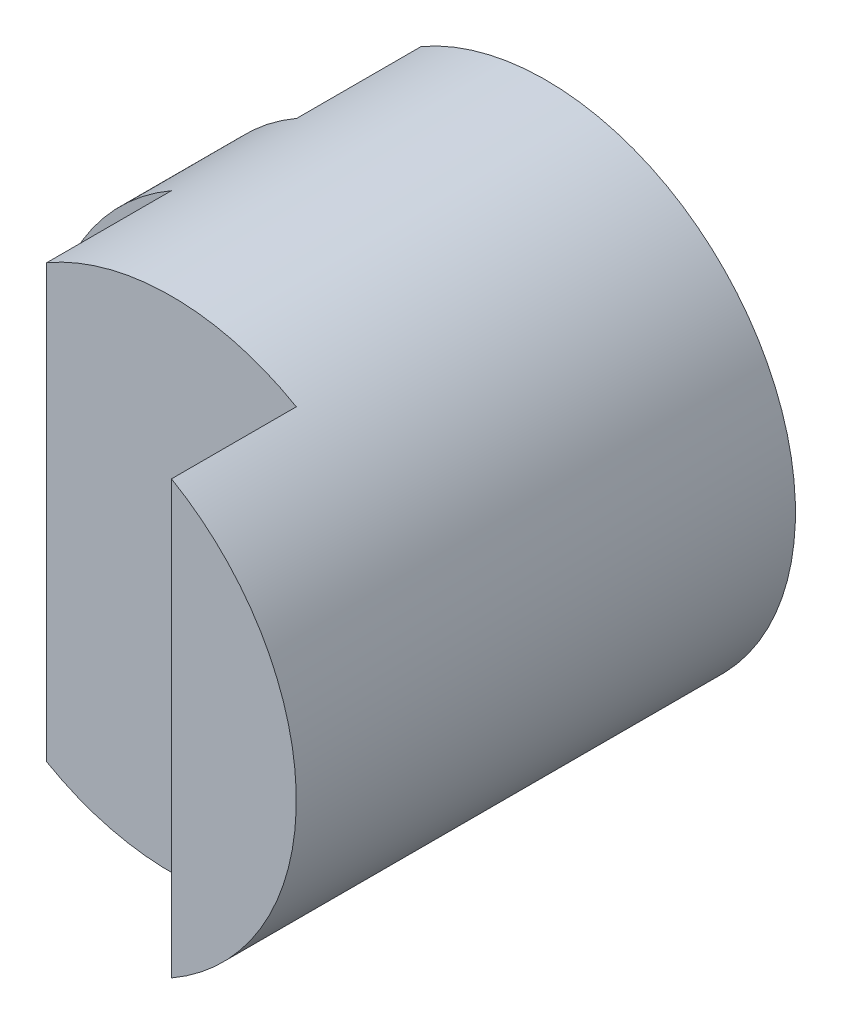
ISO-10303-21;
HEADER;
FILE_DESCRIPTION(('STEP AP214'),'2;1');
FILE_NAME('part.step','',(''),(''),'','','');
FILE_SCHEMA(('AUTOMOTIVE_DESIGN { 1 0 10303 214 1 1 1 1 }'));
ENDSEC;
DATA;
#1=APPLICATION_CONTEXT('core data for automotive mechanical design processes');
#2=APPLICATION_PROTOCOL_DEFINITION('international standard','automotive_design',2000,#1);
#3=PRODUCT_CONTEXT('',#1,'mechanical');
#4=PRODUCT('Part','Part','',(#3));
#5=PRODUCT_RELATED_PRODUCT_CATEGORY('part','',(#4));
#6=PRODUCT_DEFINITION_FORMATION('','',#4);
#7=PRODUCT_DEFINITION_CONTEXT('part definition',#1,'design');
#8=PRODUCT_DEFINITION('design','',#6,#7);
#9=PRODUCT_DEFINITION_SHAPE('','',#8);
#10=(LENGTH_UNIT() NAMED_UNIT(*) SI_UNIT(.MILLI.,.METRE.));
#11=(NAMED_UNIT(*) PLANE_ANGLE_UNIT() SI_UNIT($,.RADIAN.));
#12=(NAMED_UNIT(*) SI_UNIT($,.STERADIAN.) SOLID_ANGLE_UNIT());
#13=UNCERTAINTY_MEASURE_WITH_UNIT(LENGTH_MEASURE(1.E-05),#10,'distance_accuracy_value','');
#14=(GEOMETRIC_REPRESENTATION_CONTEXT(3) GLOBAL_UNCERTAINTY_ASSIGNED_CONTEXT((#13)) GLOBAL_UNIT_ASSIGNED_CONTEXT((#10,
#11,#12)) REPRESENTATION_CONTEXT('',''));
#15=CARTESIAN_POINT('',(0.,0.,0.));
#16=DIRECTION('',(0.,0.,1.));
#17=DIRECTION('',(1.,0.,0.));
#18=AXIS2_PLACEMENT_3D('',#15,#16,#17);
#19=CARTESIAN_POINT('',(0.,0.,4.));
#20=DIRECTION('',(0.,0.,-1.));
#21=DIRECTION('',(-1.,0.,0.));
#22=AXIS2_PLACEMENT_3D('',#19,#20,#21);
#23=CYLINDRICAL_SURFACE('',#22,2.);
#24=CARTESIAN_POINT('',(0.,0.,4.));
#25=DIRECTION('',(0.,0.,1.));
#26=DIRECTION('',(1.,0.,0.));
#27=AXIS2_PLACEMENT_3D('',#24,#25,#26);
#28=CIRCLE('',#27,2.);
#29=CARTESIAN_POINT('',(1.,-1.73205080756888,4.));
#30=VERTEX_POINT('',#29);
#31=CARTESIAN_POINT('',(1.,1.73205080756888,4.));
#32=VERTEX_POINT('',#31);
#33=EDGE_CURVE('E136',#30,#32,#28,.T.);
#34=ORIENTED_EDGE('',*,*,#33,.F.);
#35=DIRECTION('',(0.,0.,-1.));
#36=VECTOR('',#35,1.);
#37=CARTESIAN_POINT('',(1.,-1.73205080756888,4.));
#38=LINE('',#37,#36);
#39=CARTESIAN_POINT('',(1.,-1.73205080756888,3.));
#40=VERTEX_POINT('',#39);
#41=EDGE_CURVE('E47',#30,#40,#38,.T.);
#42=ORIENTED_EDGE('',*,*,#41,.T.);
#43=CARTESIAN_POINT('',(0.,0.,3.));
#44=DIRECTION('',(0.,0.,-1.));
#45=DIRECTION('',(-1.,0.,0.));
#46=AXIS2_PLACEMENT_3D('',#43,#44,#45);
#47=CIRCLE('',#46,2.);
#48=CARTESIAN_POINT('',(-1.,-1.73205080756888,3.));
#49=VERTEX_POINT('',#48);
#50=EDGE_CURVE('E105',#40,#49,#47,.T.);
#51=ORIENTED_EDGE('',*,*,#50,.T.);
#52=DIRECTION('',(0.,0.,-1.));
#53=VECTOR('',#52,1.);
#54=CARTESIAN_POINT('',(-1.,-1.73205080756888,4.));
#55=LINE('',#54,#53);
#56=CARTESIAN_POINT('',(-1.,-1.73205080756888,2.));
#57=VERTEX_POINT('',#56);
#58=EDGE_CURVE('E110',#49,#57,#55,.T.);
#59=ORIENTED_EDGE('',*,*,#58,.T.);
#60=CARTESIAN_POINT('',(0.,0.,2.));
#61=DIRECTION('',(0.,0.,-1.));
#62=DIRECTION('',(-1.,0.,0.));
#63=AXIS2_PLACEMENT_3D('',#60,#61,#62);
#64=CIRCLE('',#63,2.);
#65=CARTESIAN_POINT('',(-1.,1.73205080756888,2.));
#66=VERTEX_POINT('',#65);
#67=EDGE_CURVE('E40',#57,#66,#64,.T.);
#68=ORIENTED_EDGE('',*,*,#67,.T.);
#69=DIRECTION('',(0.,0.,-1.));
#70=VECTOR('',#69,1.);
#71=CARTESIAN_POINT('',(-1.,1.73205080756888,4.));
#72=LINE('',#71,#70);
#73=CARTESIAN_POINT('',(-1.,1.73205080756888,3.));
#74=VERTEX_POINT('',#73);
#75=EDGE_CURVE('E11',#66,#74,#72,.F.);
#76=ORIENTED_EDGE('',*,*,#75,.T.);
#77=CARTESIAN_POINT('',(1.,1.73205080756888,3.));
#78=VERTEX_POINT('',#77);
#79=EDGE_CURVE('E101',#74,#78,#47,.T.);
#80=ORIENTED_EDGE('',*,*,#79,.T.);
#81=DIRECTION('',(0.,0.,-1.));
#82=VECTOR('',#81,1.);
#83=CARTESIAN_POINT('',(1.,1.73205080756888,4.));
#84=LINE('',#83,#82);
#85=EDGE_CURVE('E94',#78,#32,#84,.F.);
#86=ORIENTED_EDGE('',*,*,#85,.T.);
#87=EDGE_LOOP('',(#34,#42,#51,#59,#68,#76,#80,#86));
#88=FACE_BOUND('',#87,.T.);
#89=CARTESIAN_POINT('',(0.,0.,0.));
#90=DIRECTION('',(0.,0.,1.));
#91=DIRECTION('',(1.,0.,0.));
#92=AXIS2_PLACEMENT_3D('',#89,#90,#91);
#93=CIRCLE('',#92,2.);
#94=CARTESIAN_POINT('',(-1.,-1.73205080756888,0.));
#95=VERTEX_POINT('',#94);
#96=CARTESIAN_POINT('',(-1.,1.73205080756888,0.));
#97=VERTEX_POINT('',#96);
#98=EDGE_CURVE('E135',#95,#97,#93,.T.);
#99=ORIENTED_EDGE('',*,*,#98,.T.);
#100=DIRECTION('',(0.,0.,-1.));
#101=VECTOR('',#100,1.);
#102=CARTESIAN_POINT('',(-1.,1.73205080756888,4.));
#103=LINE('',#102,#101);
#104=CARTESIAN_POINT('',(-1.,1.73205080756888,0.996424706562642));
#105=VERTEX_POINT('',#104);
#106=EDGE_CURVE('E55',#97,#105,#103,.F.);
#107=ORIENTED_EDGE('',*,*,#106,.T.);
#108=CARTESIAN_POINT('',(0.,0.,0.996424706562642));
#109=DIRECTION('',(0.,0.,1.));
#110=DIRECTION('',(1.,0.,0.));
#111=AXIS2_PLACEMENT_3D('',#108,#109,#110);
#112=CIRCLE('',#111,2.);
#113=CARTESIAN_POINT('',(-1.,-1.73205080756888,0.996424706562642));
#114=VERTEX_POINT('',#113);
#115=EDGE_CURVE('E98',#105,#114,#112,.T.);
#116=ORIENTED_EDGE('',*,*,#115,.T.);
#117=DIRECTION('',(0.,0.,-1.));
#118=VECTOR('',#117,1.);
#119=CARTESIAN_POINT('',(-1.,-1.73205080756888,4.));
#120=LINE('',#119,#118);
#121=EDGE_CURVE('E85',#114,#95,#120,.T.);
#122=ORIENTED_EDGE('',*,*,#121,.T.);
#123=EDGE_LOOP('',(#99,#107,#116,#122));
#124=FACE_BOUND('',#123,.T.);
#125=ADVANCED_FACE('F33',(#88,#124),#23,.T.);
#126=CARTESIAN_POINT('',(0.,0.,4.));
#127=DIRECTION('',(0.,0.,1.));
#128=DIRECTION('',(1.,0.,0.));
#129=AXIS2_PLACEMENT_3D('',#126,#127,#128);
#130=PLANE('',#129);
#131=DIRECTION('',(0.,1.,0.));
#132=VECTOR('',#131,1.);
#133=CARTESIAN_POINT('',(1.,0.,4.));
#134=LINE('',#133,#132);
#135=EDGE_CURVE('E102',#30,#32,#134,.T.);
#136=ORIENTED_EDGE('',*,*,#135,.F.);
#137=ORIENTED_EDGE('',*,*,#33,.T.);
#138=EDGE_LOOP('',(#136,#137));
#139=FACE_BOUND('',#138,.T.);
#140=ADVANCED_FACE('F142',(#139),#130,.T.);
#141=CARTESIAN_POINT('',(0.,0.,0.));
#142=DIRECTION('',(0.,0.,1.));
#143=DIRECTION('',(1.,0.,0.));
#144=AXIS2_PLACEMENT_3D('',#141,#142,#143);
#145=PLANE('',#144);
#146=ORIENTED_EDGE('',*,*,#98,.F.);
#147=DIRECTION('',(0.,1.,0.));
#148=VECTOR('',#147,1.);
#149=CARTESIAN_POINT('',(-1.,0.,0.));
#150=LINE('',#149,#148);
#151=EDGE_CURVE('E89',#95,#97,#150,.T.);
#152=ORIENTED_EDGE('',*,*,#151,.T.);
#153=EDGE_LOOP('',(#146,#152));
#154=FACE_BOUND('',#153,.T.);
#155=ADVANCED_FACE('F140',(#154),#145,.F.);
#156=CARTESIAN_POINT('',(-1.,-2.,0.996424706562642));
#157=DIRECTION('',(0.,0.,1.));
#158=DIRECTION('',(1.,0.,0.));
#159=AXIS2_PLACEMENT_3D('',#156,#157,#158);
#160=PLANE('',#159);
#161=DIRECTION('',(0.,1.,0.));
#162=VECTOR('',#161,1.);
#163=CARTESIAN_POINT('',(-1.,-2.,0.996424706562642));
#164=LINE('',#163,#162);
#165=EDGE_CURVE('E88',#114,#105,#164,.T.);
#166=ORIENTED_EDGE('',*,*,#165,.F.);
#167=ORIENTED_EDGE('',*,*,#115,.F.);
#168=EDGE_LOOP('',(#166,#167));
#169=FACE_BOUND('',#168,.T.);
#170=ADVANCED_FACE('F97',(#169),#160,.F.);
#171=CARTESIAN_POINT('',(-1.,-2.,0.996424706562642));
#172=DIRECTION('',(1.,0.,0.));
#173=DIRECTION('',(0.,0.,-1.));
#174=AXIS2_PLACEMENT_3D('',#171,#172,#173);
#175=PLANE('',#174);
#176=ORIENTED_EDGE('',*,*,#165,.T.);
#177=ORIENTED_EDGE('',*,*,#106,.F.);
#178=ORIENTED_EDGE('',*,*,#151,.F.);
#179=ORIENTED_EDGE('',*,*,#121,.F.);
#180=EDGE_LOOP('',(#176,#177,#178,#179));
#181=FACE_BOUND('',#180,.T.);
#182=ADVANCED_FACE('F87',(#181),#175,.F.);
#183=CARTESIAN_POINT('',(-2.,-2.,2.));
#184=DIRECTION('',(0.,0.,-1.));
#185=DIRECTION('',(-1.,0.,0.));
#186=AXIS2_PLACEMENT_3D('',#183,#184,#185);
#187=PLANE('',#186);
#188=ORIENTED_EDGE('',*,*,#67,.F.);
#189=DIRECTION('',(0.,1.,0.));
#190=VECTOR('',#189,1.);
#191=CARTESIAN_POINT('',(-1.,-2.,2.));
#192=LINE('',#191,#190);
#193=EDGE_CURVE('E122',#57,#66,#192,.T.);
#194=ORIENTED_EDGE('',*,*,#193,.T.);
#195=EDGE_LOOP('',(#188,#194));
#196=FACE_BOUND('',#195,.T.);
#197=ADVANCED_FACE('F125',(#196),#187,.F.);
#198=CARTESIAN_POINT('',(-1.,-2.,3.));
#199=DIRECTION('',(1.,0.,0.));
#200=DIRECTION('',(0.,0.,-1.));
#201=AXIS2_PLACEMENT_3D('',#198,#199,#200);
#202=PLANE('',#201);
#203=DIRECTION('',(0.,1.,0.));
#204=VECTOR('',#203,1.);
#205=CARTESIAN_POINT('',(-1.,-2.,3.));
#206=LINE('',#205,#204);
#207=EDGE_CURVE('E124',#49,#74,#206,.T.);
#208=ORIENTED_EDGE('',*,*,#207,.T.);
#209=ORIENTED_EDGE('',*,*,#75,.F.);
#210=ORIENTED_EDGE('',*,*,#193,.F.);
#211=ORIENTED_EDGE('',*,*,#58,.F.);
#212=EDGE_LOOP('',(#208,#209,#210,#211));
#213=FACE_BOUND('',#212,.T.);
#214=ADVANCED_FACE('F121',(#213),#202,.F.);
#215=CARTESIAN_POINT('',(-1.,-2.,3.));
#216=DIRECTION('',(0.,0.,-1.));
#217=DIRECTION('',(-1.,0.,0.));
#218=AXIS2_PLACEMENT_3D('',#215,#216,#217);
#219=PLANE('',#218);
#220=ORIENTED_EDGE('',*,*,#207,.F.);
#221=ORIENTED_EDGE('',*,*,#50,.F.);
#222=DIRECTION('',(0.,1.,0.));
#223=VECTOR('',#222,1.);
#224=CARTESIAN_POINT('',(1.,-2.,3.));
#225=LINE('',#224,#223);
#226=EDGE_CURVE('E99',#40,#78,#225,.T.);
#227=ORIENTED_EDGE('',*,*,#226,.T.);
#228=ORIENTED_EDGE('',*,*,#79,.F.);
#229=EDGE_LOOP('',(#220,#221,#227,#228));
#230=FACE_BOUND('',#229,.T.);
#231=ADVANCED_FACE('F192',(#230),#219,.F.);
#232=CARTESIAN_POINT('',(1.,-2.,5.));
#233=DIRECTION('',(1.,0.,0.));
#234=DIRECTION('',(0.,0.,-1.));
#235=AXIS2_PLACEMENT_3D('',#232,#233,#234);
#236=PLANE('',#235);
#237=ORIENTED_EDGE('',*,*,#135,.T.);
#238=ORIENTED_EDGE('',*,*,#85,.F.);
#239=ORIENTED_EDGE('',*,*,#226,.F.);
#240=ORIENTED_EDGE('',*,*,#41,.F.);
#241=EDGE_LOOP('',(#237,#238,#239,#240));
#242=FACE_BOUND('',#241,.T.);
#243=ADVANCED_FACE('F201',(#242),#236,.F.);
#244=CLOSED_SHELL('',(#125,#140,#155,#170,#182,#197,#214,#231,#243));
#245=MANIFOLD_SOLID_BREP('B2',#244);
#246=ADVANCED_BREP_SHAPE_REPRESENTATION('',(#18,#245),#14);
#247=SHAPE_DEFINITION_REPRESENTATION(#9,#246);
ENDSEC;
END-ISO-10303-21;
